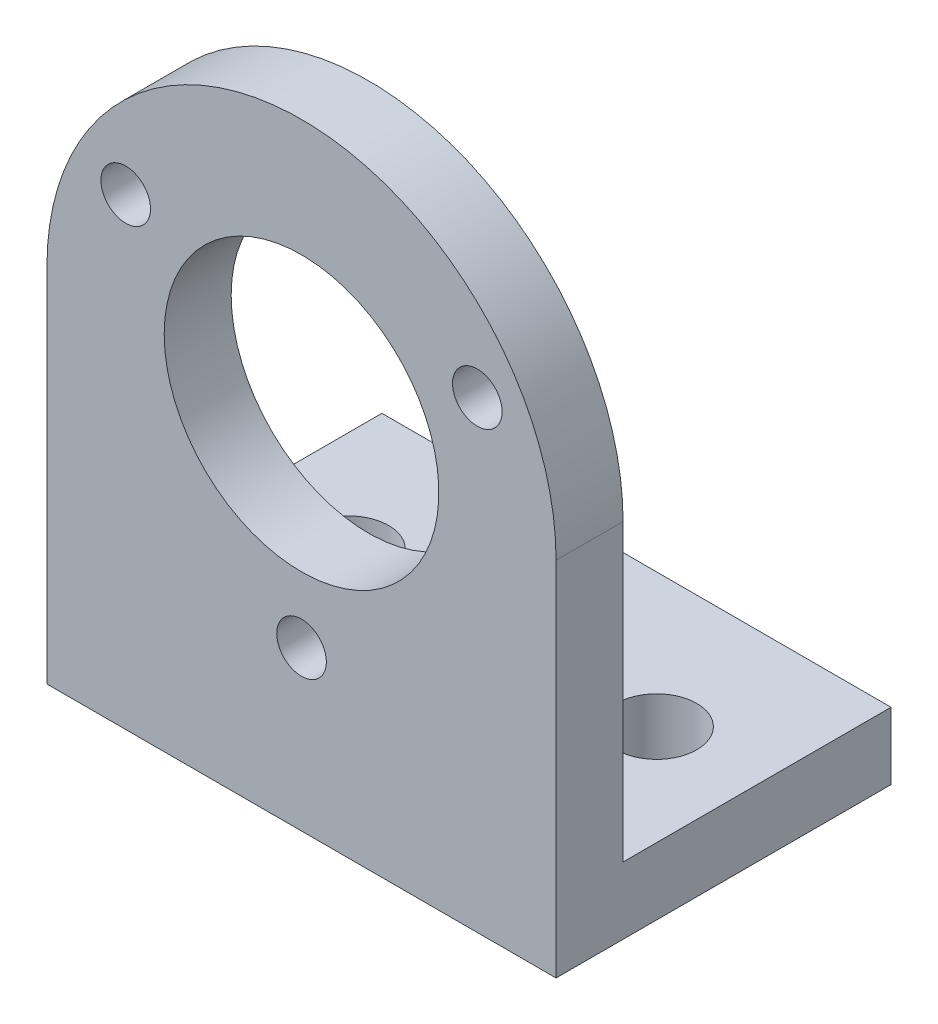
ISO-10303-21;
HEADER;
FILE_DESCRIPTION(('STEP AP214'),'2;1');
FILE_NAME('part.step','',(''),(''),'','','');
FILE_SCHEMA(('AUTOMOTIVE_DESIGN { 1 0 10303 214 1 1 1 1 }'));
ENDSEC;
DATA;
#1=APPLICATION_CONTEXT('core data for automotive mechanical design processes');
#2=APPLICATION_PROTOCOL_DEFINITION('international standard','automotive_design',2000,#1);
#3=PRODUCT_CONTEXT('',#1,'mechanical');
#4=PRODUCT('Part','Part','',(#3));
#5=PRODUCT_RELATED_PRODUCT_CATEGORY('part','',(#4));
#6=PRODUCT_DEFINITION_FORMATION('','',#4);
#7=PRODUCT_DEFINITION_CONTEXT('part definition',#1,'design');
#8=PRODUCT_DEFINITION('design','',#6,#7);
#9=PRODUCT_DEFINITION_SHAPE('','',#8);
#10=(LENGTH_UNIT() NAMED_UNIT(*) SI_UNIT(.MILLI.,.METRE.));
#11=(NAMED_UNIT(*) PLANE_ANGLE_UNIT() SI_UNIT($,.RADIAN.));
#12=(NAMED_UNIT(*) SI_UNIT($,.STERADIAN.) SOLID_ANGLE_UNIT());
#13=UNCERTAINTY_MEASURE_WITH_UNIT(LENGTH_MEASURE(1.E-05),#10,'distance_accuracy_value','');
#14=(GEOMETRIC_REPRESENTATION_CONTEXT(3) GLOBAL_UNCERTAINTY_ASSIGNED_CONTEXT((#13)) GLOBAL_UNIT_ASSIGNED_CONTEXT((#10,
#11,#12)) REPRESENTATION_CONTEXT('',''));
#15=CARTESIAN_POINT('',(0.,0.,0.));
#16=DIRECTION('',(0.,0.,1.));
#17=DIRECTION('',(1.,0.,0.));
#18=AXIS2_PLACEMENT_3D('',#15,#16,#17);
#19=CARTESIAN_POINT('',(-1.15873891022481,0.,0.));
#20=DIRECTION('',(0.,0.,1.));
#21=DIRECTION('',(1.,0.,0.));
#22=AXIS2_PLACEMENT_3D('',#19,#20,#21);
#23=PLANE('',#22);
#24=CARTESIAN_POINT('',(-1.15873891022481,0.,0.));
#25=DIRECTION('',(0.,0.,-1.));
#26=DIRECTION('',(-1.,0.,0.));
#27=AXIS2_PLACEMENT_3D('',#24,#25,#26);
#28=CIRCLE('',#27,10.25);
#29=CARTESIAN_POINT('',(-11.4087389102248,0.,0.));
#30=VERTEX_POINT('',#29);
#31=EDGE_CURVE('E142',#30,#30,#28,.T.);
#32=ORIENTED_EDGE('',*,*,#31,.F.);
#33=EDGE_LOOP('',(#32));
#34=FACE_BOUND('',#33,.T.);
#35=CARTESIAN_POINT('',(-1.15873891022481,-15.15,0.));
#36=DIRECTION('',(0.,0.,-1.));
#37=DIRECTION('',(-1.,0.,0.));
#38=AXIS2_PLACEMENT_3D('',#35,#36,#37);
#39=CIRCLE('',#38,1.85);
#40=CARTESIAN_POINT('',(-3.00873891022481,-15.15,0.));
#41=VERTEX_POINT('',#40);
#42=EDGE_CURVE('E139',#41,#41,#39,.T.);
#43=ORIENTED_EDGE('',*,*,#42,.F.);
#44=EDGE_LOOP('',(#43));
#45=FACE_BOUND('',#44,.T.);
#46=CARTESIAN_POINT('',(11.9615459571095,7.57499999999997,0.));
#47=DIRECTION('',(0.,0.,-1.));
#48=DIRECTION('',(-1.,0.,0.));
#49=AXIS2_PLACEMENT_3D('',#46,#47,#48);
#50=CIRCLE('',#49,1.85);
#51=CARTESIAN_POINT('',(10.1115459571095,7.57499999999997,0.));
#52=VERTEX_POINT('',#51);
#53=EDGE_CURVE('E146',#52,#52,#50,.T.);
#54=ORIENTED_EDGE('',*,*,#53,.F.);
#55=EDGE_LOOP('',(#54));
#56=FACE_BOUND('',#55,.T.);
#57=CARTESIAN_POINT('',(-14.2790237775591,7.57499999999997,0.));
#58=DIRECTION('',(0.,0.,-1.));
#59=DIRECTION('',(-1.,0.,0.));
#60=AXIS2_PLACEMENT_3D('',#57,#58,#59);
#61=CIRCLE('',#60,1.85);
#62=CARTESIAN_POINT('',(-16.1290237775591,7.57499999999997,0.));
#63=VERTEX_POINT('',#62);
#64=EDGE_CURVE('E152',#63,#63,#61,.T.);
#65=ORIENTED_EDGE('',*,*,#64,.F.);
#66=EDGE_LOOP('',(#65));
#67=FACE_BOUND('',#66,.T.);
#68=DIRECTION('',(1.,0.,0.));
#69=VECTOR('',#68,1.);
#70=CARTESIAN_POINT('',(17.8412610897752,-22.,0.));
#71=LINE('',#70,#69);
#72=CARTESIAN_POINT('',(-20.1587389102248,-22.,0.));
#73=VERTEX_POINT('',#72);
#74=CARTESIAN_POINT('',(17.8412610897752,-22.,0.));
#75=VERTEX_POINT('',#74);
#76=EDGE_CURVE('E59',#73,#75,#71,.T.);
#77=ORIENTED_EDGE('',*,*,#76,.F.);
#78=DIRECTION('',(0.,-1.,0.));
#79=VECTOR('',#78,1.);
#80=CARTESIAN_POINT('',(-20.1587389102248,0.,0.));
#81=LINE('',#80,#79);
#82=CARTESIAN_POINT('',(-20.1587389102248,0.,0.));
#83=VERTEX_POINT('',#82);
#84=EDGE_CURVE('E171',#83,#73,#81,.T.);
#85=ORIENTED_EDGE('',*,*,#84,.F.);
#86=CARTESIAN_POINT('',(-1.15873891022481,0.,0.));
#87=DIRECTION('',(0.,0.,1.));
#88=DIRECTION('',(1.,0.,0.));
#89=AXIS2_PLACEMENT_3D('',#86,#87,#88);
#90=CIRCLE('',#89,19.);
#91=CARTESIAN_POINT('',(17.8412610897752,0.,0.));
#92=VERTEX_POINT('',#91);
#93=EDGE_CURVE('E160',#92,#83,#90,.T.);
#94=ORIENTED_EDGE('',*,*,#93,.F.);
#95=DIRECTION('',(0.,1.,0.));
#96=VECTOR('',#95,1.);
#97=CARTESIAN_POINT('',(17.8412610897752,-27.,0.));
#98=LINE('',#97,#96);
#99=EDGE_CURVE('E81',#75,#92,#98,.T.);
#100=ORIENTED_EDGE('',*,*,#99,.F.);
#101=EDGE_LOOP('',(#77,#85,#94,#100));
#102=FACE_BOUND('',#101,.T.);
#103=ADVANCED_FACE('F44',(#34,#45,#56,#67,#102),#23,.F.);
#104=CARTESIAN_POINT('',(-1.15873891022481,0.,5.));
#105=DIRECTION('',(0.,0.,-1.));
#106=DIRECTION('',(-1.,0.,0.));
#107=AXIS2_PLACEMENT_3D('',#104,#105,#106);
#108=CYLINDRICAL_SURFACE('',#107,19.);
#109=ORIENTED_EDGE('',*,*,#93,.T.);
#110=DIRECTION('',(0.,0.,-1.));
#111=VECTOR('',#110,1.);
#112=CARTESIAN_POINT('',(-20.1587389102248,0.,5.));
#113=LINE('',#112,#111);
#114=CARTESIAN_POINT('',(-20.1587389102248,0.,5.));
#115=VERTEX_POINT('',#114);
#116=EDGE_CURVE('E11',#115,#83,#113,.T.);
#117=ORIENTED_EDGE('',*,*,#116,.F.);
#118=CARTESIAN_POINT('',(-1.15873891022481,0.,5.));
#119=DIRECTION('',(0.,0.,1.));
#120=DIRECTION('',(1.,0.,0.));
#121=AXIS2_PLACEMENT_3D('',#118,#119,#120);
#122=CIRCLE('',#121,19.);
#123=CARTESIAN_POINT('',(17.8412610897752,0.,5.));
#124=VERTEX_POINT('',#123);
#125=EDGE_CURVE('E163',#124,#115,#122,.T.);
#126=ORIENTED_EDGE('',*,*,#125,.F.);
#127=DIRECTION('',(0.,0.,-1.));
#128=VECTOR('',#127,1.);
#129=CARTESIAN_POINT('',(17.8412610897752,0.,5.));
#130=LINE('',#129,#128);
#131=EDGE_CURVE('E111',#124,#92,#130,.T.);
#132=ORIENTED_EDGE('',*,*,#131,.T.);
#133=EDGE_LOOP('',(#109,#117,#126,#132));
#134=FACE_BOUND('',#133,.T.);
#135=ADVANCED_FACE('F46',(#134),#108,.T.);
#136=CARTESIAN_POINT('',(-20.1587389102248,0.,5.));
#137=DIRECTION('',(1.,0.,0.));
#138=DIRECTION('',(0.,1.,0.));
#139=AXIS2_PLACEMENT_3D('',#136,#137,#138);
#140=PLANE('',#139);
#141=ORIENTED_EDGE('',*,*,#84,.T.);
#142=DIRECTION('',(0.,0.,1.));
#143=VECTOR('',#142,1.);
#144=CARTESIAN_POINT('',(-20.1587389102248,-22.,-20.));
#145=LINE('',#144,#143);
#146=CARTESIAN_POINT('',(-20.1587389102248,-22.,-20.));
#147=VERTEX_POINT('',#146);
#148=EDGE_CURVE('E135',#147,#73,#145,.T.);
#149=ORIENTED_EDGE('',*,*,#148,.F.);
#150=DIRECTION('',(0.,1.,0.));
#151=VECTOR('',#150,1.);
#152=CARTESIAN_POINT('',(-20.1587389102248,-27.,-20.));
#153=LINE('',#152,#151);
#154=CARTESIAN_POINT('',(-20.1587389102248,-27.,-20.));
#155=VERTEX_POINT('',#154);
#156=EDGE_CURVE('E118',#155,#147,#153,.T.);
#157=ORIENTED_EDGE('',*,*,#156,.F.);
#158=DIRECTION('',(0.,0.,-1.));
#159=VECTOR('',#158,1.);
#160=CARTESIAN_POINT('',(-20.1587389102248,-27.,5.));
#161=LINE('',#160,#159);
#162=CARTESIAN_POINT('',(-20.1587389102248,-27.,5.));
#163=VERTEX_POINT('',#162);
#164=EDGE_CURVE('E52',#163,#155,#161,.T.);
#165=ORIENTED_EDGE('',*,*,#164,.F.);
#166=DIRECTION('',(0.,-1.,0.));
#167=VECTOR('',#166,1.);
#168=CARTESIAN_POINT('',(-20.1587389102248,0.,5.));
#169=LINE('',#168,#167);
#170=EDGE_CURVE('E88',#115,#163,#169,.T.);
#171=ORIENTED_EDGE('',*,*,#170,.F.);
#172=ORIENTED_EDGE('',*,*,#116,.T.);
#173=EDGE_LOOP('',(#141,#149,#157,#165,#171,#172));
#174=FACE_BOUND('',#173,.T.);
#175=ADVANCED_FACE('F179',(#174),#140,.F.);
#176=CARTESIAN_POINT('',(-20.1587389102248,-27.,5.));
#177=DIRECTION('',(0.,1.,0.));
#178=DIRECTION('',(0.,0.,1.));
#179=AXIS2_PLACEMENT_3D('',#176,#177,#178);
#180=PLANE('',#179);
#181=CARTESIAN_POINT('',(10.3412610897752,-27.,-10.));
#182=DIRECTION('',(0.,1.,0.));
#183=DIRECTION('',(0.,0.,1.));
#184=AXIS2_PLACEMENT_3D('',#181,#182,#183);
#185=CIRCLE('',#184,3.);
#186=CARTESIAN_POINT('',(10.3412610897752,-27.,-7.));
#187=VERTEX_POINT('',#186);
#188=EDGE_CURVE('E125',#187,#187,#185,.T.);
#189=ORIENTED_EDGE('',*,*,#188,.T.);
#190=EDGE_LOOP('',(#189));
#191=FACE_BOUND('',#190,.T.);
#192=CARTESIAN_POINT('',(-12.6587389102248,-27.,-10.));
#193=DIRECTION('',(0.,1.,0.));
#194=DIRECTION('',(0.,0.,1.));
#195=AXIS2_PLACEMENT_3D('',#192,#193,#194);
#196=CIRCLE('',#195,3.);
#197=CARTESIAN_POINT('',(-12.6587389102248,-27.,-7.));
#198=VERTEX_POINT('',#197);
#199=EDGE_CURVE('E128',#198,#198,#196,.T.);
#200=ORIENTED_EDGE('',*,*,#199,.T.);
#201=EDGE_LOOP('',(#200));
#202=FACE_BOUND('',#201,.T.);
#203=ORIENTED_EDGE('',*,*,#164,.T.);
#204=DIRECTION('',(-1.,0.,0.));
#205=VECTOR('',#204,1.);
#206=CARTESIAN_POINT('',(17.8412610897752,-27.,-20.));
#207=LINE('',#206,#205);
#208=CARTESIAN_POINT('',(17.8412610897752,-27.,-20.));
#209=VERTEX_POINT('',#208);
#210=EDGE_CURVE('E114',#209,#155,#207,.T.);
#211=ORIENTED_EDGE('',*,*,#210,.F.);
#212=DIRECTION('',(0.,0.,-1.));
#213=VECTOR('',#212,1.);
#214=CARTESIAN_POINT('',(17.8412610897752,-27.,5.));
#215=LINE('',#214,#213);
#216=CARTESIAN_POINT('',(17.8412610897752,-27.,5.));
#217=VERTEX_POINT('',#216);
#218=EDGE_CURVE('E104',#217,#209,#215,.T.);
#219=ORIENTED_EDGE('',*,*,#218,.F.);
#220=DIRECTION('',(1.,0.,0.));
#221=VECTOR('',#220,1.);
#222=CARTESIAN_POINT('',(-20.1587389102248,-27.,5.));
#223=LINE('',#222,#221);
#224=EDGE_CURVE('E166',#163,#217,#223,.T.);
#225=ORIENTED_EDGE('',*,*,#224,.F.);
#226=EDGE_LOOP('',(#203,#211,#219,#225));
#227=FACE_BOUND('',#226,.T.);
#228=ADVANCED_FACE('F115',(#191,#202,#227),#180,.F.);
#229=CARTESIAN_POINT('',(17.8412610897752,-27.,5.));
#230=DIRECTION('',(-1.,0.,0.));
#231=DIRECTION('',(0.,0.,1.));
#232=AXIS2_PLACEMENT_3D('',#229,#230,#231);
#233=PLANE('',#232);
#234=ORIENTED_EDGE('',*,*,#218,.T.);
#235=DIRECTION('',(0.,-1.,0.));
#236=VECTOR('',#235,1.);
#237=CARTESIAN_POINT('',(17.8412610897752,-27.,-20.));
#238=LINE('',#237,#236);
#239=CARTESIAN_POINT('',(17.8412610897752,-22.,-20.));
#240=VERTEX_POINT('',#239);
#241=EDGE_CURVE('E108',#240,#209,#238,.T.);
#242=ORIENTED_EDGE('',*,*,#241,.F.);
#243=DIRECTION('',(0.,0.,1.));
#244=VECTOR('',#243,1.);
#245=CARTESIAN_POINT('',(17.8412610897752,-22.,-20.));
#246=LINE('',#245,#244);
#247=EDGE_CURVE('E132',#240,#75,#246,.T.);
#248=ORIENTED_EDGE('',*,*,#247,.T.);
#249=ORIENTED_EDGE('',*,*,#99,.T.);
#250=ORIENTED_EDGE('',*,*,#131,.F.);
#251=DIRECTION('',(0.,1.,0.));
#252=VECTOR('',#251,1.);
#253=CARTESIAN_POINT('',(17.8412610897752,-27.,5.));
#254=LINE('',#253,#252);
#255=EDGE_CURVE('E68',#217,#124,#254,.T.);
#256=ORIENTED_EDGE('',*,*,#255,.F.);
#257=EDGE_LOOP('',(#234,#242,#248,#249,#250,#256));
#258=FACE_BOUND('',#257,.T.);
#259=ADVANCED_FACE('F106',(#258),#233,.F.);
#260=CARTESIAN_POINT('',(-1.15873891022481,0.,5.));
#261=DIRECTION('',(0.,0.,1.));
#262=DIRECTION('',(1.,0.,0.));
#263=AXIS2_PLACEMENT_3D('',#260,#261,#262);
#264=PLANE('',#263);
#265=CARTESIAN_POINT('',(-14.2790237775591,7.57499999999997,5.));
#266=DIRECTION('',(0.,0.,-1.));
#267=DIRECTION('',(-1.,0.,0.));
#268=AXIS2_PLACEMENT_3D('',#265,#266,#267);
#269=CIRCLE('',#268,1.85);
#270=CARTESIAN_POINT('',(-16.1290237775591,7.57499999999997,5.));
#271=VERTEX_POINT('',#270);
#272=EDGE_CURVE('E138',#271,#271,#269,.T.);
#273=ORIENTED_EDGE('',*,*,#272,.T.);
#274=EDGE_LOOP('',(#273));
#275=FACE_BOUND('',#274,.T.);
#276=CARTESIAN_POINT('',(11.9615459571095,7.57499999999997,5.));
#277=DIRECTION('',(0.,0.,-1.));
#278=DIRECTION('',(-1.,0.,0.));
#279=AXIS2_PLACEMENT_3D('',#276,#277,#278);
#280=CIRCLE('',#279,1.85);
#281=CARTESIAN_POINT('',(10.1115459571095,7.57499999999997,5.));
#282=VERTEX_POINT('',#281);
#283=EDGE_CURVE('E149',#282,#282,#280,.T.);
#284=ORIENTED_EDGE('',*,*,#283,.T.);
#285=EDGE_LOOP('',(#284));
#286=FACE_BOUND('',#285,.T.);
#287=CARTESIAN_POINT('',(-1.15873891022481,-15.15,5.));
#288=DIRECTION('',(0.,0.,-1.));
#289=DIRECTION('',(-1.,0.,0.));
#290=AXIS2_PLACEMENT_3D('',#287,#288,#289);
#291=CIRCLE('',#290,1.85);
#292=CARTESIAN_POINT('',(-3.00873891022481,-15.15,5.));
#293=VERTEX_POINT('',#292);
#294=EDGE_CURVE('E143',#293,#293,#291,.T.);
#295=ORIENTED_EDGE('',*,*,#294,.T.);
#296=EDGE_LOOP('',(#295));
#297=FACE_BOUND('',#296,.T.);
#298=CARTESIAN_POINT('',(-1.15873891022481,0.,5.));
#299=DIRECTION('',(0.,0.,-1.));
#300=DIRECTION('',(-1.,0.,0.));
#301=AXIS2_PLACEMENT_3D('',#298,#299,#300);
#302=CIRCLE('',#301,10.25);
#303=CARTESIAN_POINT('',(-11.4087389102248,0.,5.));
#304=VERTEX_POINT('',#303);
#305=EDGE_CURVE('E157',#304,#304,#302,.T.);
#306=ORIENTED_EDGE('',*,*,#305,.T.);
#307=EDGE_LOOP('',(#306));
#308=FACE_BOUND('',#307,.T.);
#309=ORIENTED_EDGE('',*,*,#125,.T.);
#310=ORIENTED_EDGE('',*,*,#170,.T.);
#311=ORIENTED_EDGE('',*,*,#224,.T.);
#312=ORIENTED_EDGE('',*,*,#255,.T.);
#313=EDGE_LOOP('',(#309,#310,#311,#312));
#314=FACE_BOUND('',#313,.T.);
#315=ADVANCED_FACE('F196',(#275,#286,#297,#308,#314),#264,.T.);
#316=CARTESIAN_POINT('',(-1.15873891022481,0.,5.));
#317=DIRECTION('',(0.,0.,-1.));
#318=DIRECTION('',(-1.,0.,0.));
#319=AXIS2_PLACEMENT_3D('',#316,#317,#318);
#320=CYLINDRICAL_SURFACE('',#319,10.25);
#321=ORIENTED_EDGE('',*,*,#305,.F.);
#322=EDGE_LOOP('',(#321));
#323=FACE_BOUND('',#322,.T.);
#324=ORIENTED_EDGE('',*,*,#31,.T.);
#325=EDGE_LOOP('',(#324));
#326=FACE_BOUND('',#325,.T.);
#327=ADVANCED_FACE('F202',(#323,#326),#320,.F.);
#328=CARTESIAN_POINT('',(-1.15873891022481,-15.15,5.));
#329=DIRECTION('',(0.,0.,-1.));
#330=DIRECTION('',(-1.,0.,0.));
#331=AXIS2_PLACEMENT_3D('',#328,#329,#330);
#332=CYLINDRICAL_SURFACE('',#331,1.85);
#333=ORIENTED_EDGE('',*,*,#294,.F.);
#334=EDGE_LOOP('',(#333));
#335=FACE_BOUND('',#334,.T.);
#336=ORIENTED_EDGE('',*,*,#42,.T.);
#337=EDGE_LOOP('',(#336));
#338=FACE_BOUND('',#337,.T.);
#339=ADVANCED_FACE('F207',(#335,#338),#332,.F.);
#340=CARTESIAN_POINT('',(11.9615459571095,7.57499999999997,5.));
#341=DIRECTION('',(0.,0.,-1.));
#342=DIRECTION('',(-1.,0.,0.));
#343=AXIS2_PLACEMENT_3D('',#340,#341,#342);
#344=CYLINDRICAL_SURFACE('',#343,1.85);
#345=ORIENTED_EDGE('',*,*,#283,.F.);
#346=EDGE_LOOP('',(#345));
#347=FACE_BOUND('',#346,.T.);
#348=ORIENTED_EDGE('',*,*,#53,.T.);
#349=EDGE_LOOP('',(#348));
#350=FACE_BOUND('',#349,.T.);
#351=ADVANCED_FACE('F228',(#347,#350),#344,.F.);
#352=CARTESIAN_POINT('',(-14.2790237775591,7.57499999999997,5.));
#353=DIRECTION('',(0.,0.,-1.));
#354=DIRECTION('',(-1.,0.,0.));
#355=AXIS2_PLACEMENT_3D('',#352,#353,#354);
#356=CYLINDRICAL_SURFACE('',#355,1.85);
#357=ORIENTED_EDGE('',*,*,#272,.F.);
#358=EDGE_LOOP('',(#357));
#359=FACE_BOUND('',#358,.T.);
#360=ORIENTED_EDGE('',*,*,#64,.T.);
#361=EDGE_LOOP('',(#360));
#362=FACE_BOUND('',#361,.T.);
#363=ADVANCED_FACE('F219',(#359,#362),#356,.F.);
#364=CARTESIAN_POINT('',(17.8412610897752,-22.,-20.));
#365=DIRECTION('',(0.,-1.,0.));
#366=DIRECTION('',(0.,0.,-1.));
#367=AXIS2_PLACEMENT_3D('',#364,#365,#366);
#368=PLANE('',#367);
#369=CARTESIAN_POINT('',(10.3412610897752,-22.,-10.));
#370=DIRECTION('',(0.,1.,0.));
#371=DIRECTION('',(0.,0.,1.));
#372=AXIS2_PLACEMENT_3D('',#369,#370,#371);
#373=CIRCLE('',#372,3.);
#374=CARTESIAN_POINT('',(10.3412610897752,-22.,-7.));
#375=VERTEX_POINT('',#374);
#376=EDGE_CURVE('E395',#375,#375,#373,.T.);
#377=ORIENTED_EDGE('',*,*,#376,.F.);
#378=EDGE_LOOP('',(#377));
#379=FACE_BOUND('',#378,.T.);
#380=CARTESIAN_POINT('',(-12.6587389102248,-22.,-10.));
#381=DIRECTION('',(0.,1.,0.));
#382=DIRECTION('',(0.,0.,1.));
#383=AXIS2_PLACEMENT_3D('',#380,#381,#382);
#384=CIRCLE('',#383,3.);
#385=CARTESIAN_POINT('',(-12.6587389102248,-22.,-7.));
#386=VERTEX_POINT('',#385);
#387=EDGE_CURVE('E396',#386,#386,#384,.T.);
#388=ORIENTED_EDGE('',*,*,#387,.F.);
#389=EDGE_LOOP('',(#388));
#390=FACE_BOUND('',#389,.T.);
#391=ORIENTED_EDGE('',*,*,#76,.T.);
#392=ORIENTED_EDGE('',*,*,#247,.F.);
#393=DIRECTION('',(1.,0.,0.));
#394=VECTOR('',#393,1.);
#395=CARTESIAN_POINT('',(17.8412610897752,-22.,-20.));
#396=LINE('',#395,#394);
#397=EDGE_CURVE('E122',#147,#240,#396,.T.);
#398=ORIENTED_EDGE('',*,*,#397,.F.);
#399=ORIENTED_EDGE('',*,*,#148,.T.);
#400=EDGE_LOOP('',(#391,#392,#398,#399));
#401=FACE_BOUND('',#400,.T.);
#402=ADVANCED_FACE('F217',(#379,#390,#401),#368,.F.);
#403=CARTESIAN_POINT('',(0.,0.,-20.));
#404=DIRECTION('',(0.,0.,1.));
#405=DIRECTION('',(1.,0.,0.));
#406=AXIS2_PLACEMENT_3D('',#403,#404,#405);
#407=PLANE('',#406);
#408=ORIENTED_EDGE('',*,*,#241,.T.);
#409=ORIENTED_EDGE('',*,*,#210,.T.);
#410=ORIENTED_EDGE('',*,*,#156,.T.);
#411=ORIENTED_EDGE('',*,*,#397,.T.);
#412=EDGE_LOOP('',(#408,#409,#410,#411));
#413=FACE_BOUND('',#412,.T.);
#414=ADVANCED_FACE('F120',(#413),#407,.F.);
#415=CARTESIAN_POINT('',(-12.6587389102248,-27.,-10.));
#416=DIRECTION('',(0.,1.,0.));
#417=DIRECTION('',(0.,0.,1.));
#418=AXIS2_PLACEMENT_3D('',#415,#416,#417);
#419=CYLINDRICAL_SURFACE('',#418,3.);
#420=ORIENTED_EDGE('',*,*,#199,.F.);
#421=EDGE_LOOP('',(#420));
#422=FACE_BOUND('',#421,.T.);
#423=ORIENTED_EDGE('',*,*,#387,.T.);
#424=EDGE_LOOP('',(#423));
#425=FACE_BOUND('',#424,.T.);
#426=ADVANCED_FACE('F226',(#422,#425),#419,.F.);
#427=CARTESIAN_POINT('',(10.3412610897752,-27.,-10.));
#428=DIRECTION('',(0.,1.,0.));
#429=DIRECTION('',(0.,0.,1.));
#430=AXIS2_PLACEMENT_3D('',#427,#428,#429);
#431=CYLINDRICAL_SURFACE('',#430,3.);
#432=ORIENTED_EDGE('',*,*,#188,.F.);
#433=EDGE_LOOP('',(#432));
#434=FACE_BOUND('',#433,.T.);
#435=ORIENTED_EDGE('',*,*,#376,.T.);
#436=EDGE_LOOP('',(#435));
#437=FACE_BOUND('',#436,.T.);
#438=ADVANCED_FACE('F276',(#434,#437),#431,.F.);
#439=CLOSED_SHELL('',(#103,#135,#175,#228,#259,#315,#327,#339,#351,#363,#402,#414,#426,#438));
#440=MANIFOLD_SOLID_BREP('B2',#439);
#441=ADVANCED_BREP_SHAPE_REPRESENTATION('',(#18,#440),#14);
#442=SHAPE_DEFINITION_REPRESENTATION(#9,#441);
ENDSEC;
END-ISO-10303-21;
